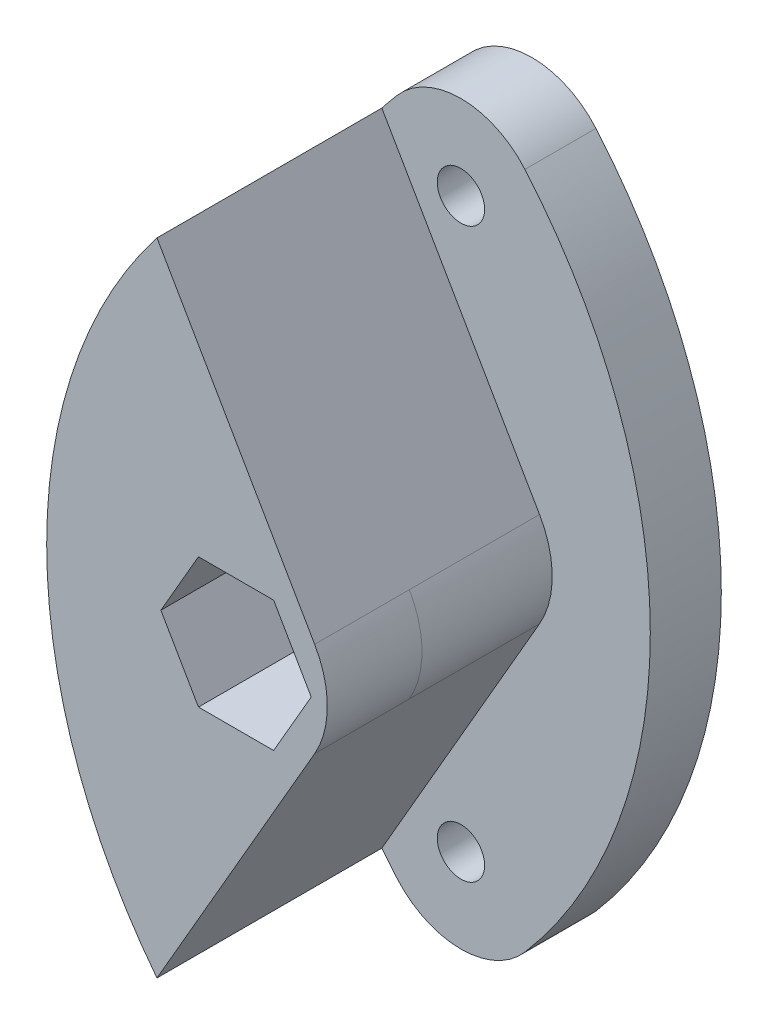
ISO-10303-21;
HEADER;
FILE_DESCRIPTION(('STEP AP214'),'2;1');
FILE_NAME('part.step','',(''),(''),'','','');
FILE_SCHEMA(('AUTOMOTIVE_DESIGN { 1 0 10303 214 1 1 1 1 }'));
ENDSEC;
DATA;
#1=APPLICATION_CONTEXT('core data for automotive mechanical design processes');
#2=APPLICATION_PROTOCOL_DEFINITION('international standard','automotive_design',2000,#1);
#3=PRODUCT_CONTEXT('',#1,'mechanical');
#4=PRODUCT('Part','Part','',(#3));
#5=PRODUCT_RELATED_PRODUCT_CATEGORY('part','',(#4));
#6=PRODUCT_DEFINITION_FORMATION('','',#4);
#7=PRODUCT_DEFINITION_CONTEXT('part definition',#1,'design');
#8=PRODUCT_DEFINITION('design','',#6,#7);
#9=PRODUCT_DEFINITION_SHAPE('','',#8);
#10=(LENGTH_UNIT() NAMED_UNIT(*) SI_UNIT(.MILLI.,.METRE.));
#11=(NAMED_UNIT(*) PLANE_ANGLE_UNIT() SI_UNIT($,.RADIAN.));
#12=(NAMED_UNIT(*) SI_UNIT($,.STERADIAN.) SOLID_ANGLE_UNIT());
#13=UNCERTAINTY_MEASURE_WITH_UNIT(LENGTH_MEASURE(1.E-05),#10,'distance_accuracy_value','');
#14=(GEOMETRIC_REPRESENTATION_CONTEXT(3) GLOBAL_UNCERTAINTY_ASSIGNED_CONTEXT((#13)) GLOBAL_UNIT_ASSIGNED_CONTEXT((#10,
#11,#12)) REPRESENTATION_CONTEXT('',''));
#15=CARTESIAN_POINT('',(0.,0.,0.));
#16=DIRECTION('',(0.,0.,1.));
#17=DIRECTION('',(1.,0.,0.));
#18=AXIS2_PLACEMENT_3D('',#15,#16,#17);
#19=CARTESIAN_POINT('',(13.856406460551,7.99999999999999,-5.5));
#20=DIRECTION('',(0.866025403784439,0.5,0.));
#21=DIRECTION('',(-0.5,0.866025403784439,0.));
#22=AXIS2_PLACEMENT_3D('',#19,#20,#21);
#23=PLANE('',#22);
#24=DIRECTION('',(-0.5,0.866025403784439,0.));
#25=VECTOR('',#24,1.);
#26=CARTESIAN_POINT('',(13.856406460551,7.99999999999999,4.));
#27=LINE('',#26,#25);
#28=CARTESIAN_POINT('',(17.3205080756888,1.99999999999999,4.));
#29=VERTEX_POINT('',#28);
#30=CARTESIAN_POINT('',(10.6588729132802,13.538290562779,4.));
#31=VERTEX_POINT('',#30);
#32=EDGE_CURVE('E181',#29,#31,#27,.T.);
#33=ORIENTED_EDGE('',*,*,#32,.F.);
#34=DIRECTION('',(0.,0.,-1.));
#35=VECTOR('',#34,1.);
#36=CARTESIAN_POINT('',(17.3205080756888,1.99999999999999,-5.5));
#37=LINE('',#36,#35);
#38=CARTESIAN_POINT('',(17.3205080756888,1.99999999999999,0.));
#39=VERTEX_POINT('',#38);
#40=EDGE_CURVE('E308',#29,#39,#37,.T.);
#41=ORIENTED_EDGE('',*,*,#40,.T.);
#42=DIRECTION('',(0.,0.,1.));
#43=VECTOR('',#42,1.);
#44=CARTESIAN_POINT('',(17.3205080756888,1.99999999999999,-5.5));
#45=LINE('',#44,#43);
#46=CARTESIAN_POINT('',(17.3205080756888,1.99999999999999,-5.5));
#47=VERTEX_POINT('',#46);
#48=EDGE_CURVE('E295',#39,#47,#45,.F.);
#49=ORIENTED_EDGE('',*,*,#48,.T.);
#50=DIRECTION('',(-0.5,0.866025403784439,0.));
#51=VECTOR('',#50,1.);
#52=CARTESIAN_POINT('',(13.856406460551,7.99999999999999,-5.5));
#53=LINE('',#52,#51);
#54=CARTESIAN_POINT('',(10.6588729132802,13.538290562779,-5.5));
#55=VERTEX_POINT('',#54);
#56=EDGE_CURVE('E256',#47,#55,#53,.T.);
#57=ORIENTED_EDGE('',*,*,#56,.T.);
#58=DIRECTION('',(0.,0.,1.));
#59=VECTOR('',#58,1.);
#60=CARTESIAN_POINT('',(10.6588729132802,13.538290562779,-5.5));
#61=LINE('',#60,#59);
#62=EDGE_CURVE('E277',#55,#31,#61,.T.);
#63=ORIENTED_EDGE('',*,*,#62,.T.);
#64=EDGE_LOOP('',(#33,#41,#49,#57,#63));
#65=FACE_BOUND('',#64,.T.);
#66=ADVANCED_FACE('F36',(#65),#23,.T.);
#67=CARTESIAN_POINT('',(13.856406460551,-8.,-5.5));
#68=DIRECTION('',(0.866025403784439,-0.5,0.));
#69=DIRECTION('',(0.5,0.866025403784439,0.));
#70=AXIS2_PLACEMENT_3D('',#67,#68,#69);
#71=PLANE('',#70);
#72=DIRECTION('',(0.,0.,1.));
#73=VECTOR('',#72,1.);
#74=CARTESIAN_POINT('',(17.3205080756888,-2.00000000000001,-5.5));
#75=LINE('',#74,#73);
#76=CARTESIAN_POINT('',(17.3205080756888,-2.00000000000001,-5.5));
#77=VERTEX_POINT('',#76);
#78=CARTESIAN_POINT('',(17.3205080756888,-2.00000000000001,0.));
#79=VERTEX_POINT('',#78);
#80=EDGE_CURVE('E282',#77,#79,#75,.T.);
#81=ORIENTED_EDGE('',*,*,#80,.T.);
#82=DIRECTION('',(0.,0.,-1.));
#83=VECTOR('',#82,1.);
#84=CARTESIAN_POINT('',(17.3205080756888,-2.00000000000001,-5.5));
#85=LINE('',#84,#83);
#86=CARTESIAN_POINT('',(17.3205080756888,-2.00000000000001,4.));
#87=VERTEX_POINT('',#86);
#88=EDGE_CURVE('E44',#79,#87,#85,.F.);
#89=ORIENTED_EDGE('',*,*,#88,.T.);
#90=DIRECTION('',(0.5,0.866025403784439,0.));
#91=VECTOR('',#90,1.);
#92=CARTESIAN_POINT('',(13.856406460551,-8.,4.));
#93=LINE('',#92,#91);
#94=CARTESIAN_POINT('',(10.6588729132802,-13.538290562779,4.));
#95=VERTEX_POINT('',#94);
#96=EDGE_CURVE('E186',#95,#87,#93,.T.);
#97=ORIENTED_EDGE('',*,*,#96,.F.);
#98=DIRECTION('',(0.,0.,1.));
#99=VECTOR('',#98,1.);
#100=CARTESIAN_POINT('',(10.6588729132802,-13.538290562779,-5.5));
#101=LINE('',#100,#99);
#102=CARTESIAN_POINT('',(10.6588729132802,-13.538290562779,-5.5));
#103=VERTEX_POINT('',#102);
#104=EDGE_CURVE('E279',#103,#95,#101,.T.);
#105=ORIENTED_EDGE('',*,*,#104,.F.);
#106=DIRECTION('',(0.5,0.866025403784439,0.));
#107=VECTOR('',#106,1.);
#108=CARTESIAN_POINT('',(13.856406460551,-8.,-5.5));
#109=LINE('',#108,#107);
#110=EDGE_CURVE('E280',#103,#77,#109,.T.);
#111=ORIENTED_EDGE('',*,*,#110,.T.);
#112=EDGE_LOOP('',(#81,#89,#97,#105,#111));
#113=FACE_BOUND('',#112,.T.);
#114=ADVANCED_FACE('F355',(#113),#71,.T.);
#115=CARTESIAN_POINT('',(28.,0.,-5.5));
#116=DIRECTION('',(0.,0.,1.));
#117=DIRECTION('',(1.,0.,0.));
#118=AXIS2_PLACEMENT_3D('',#115,#116,#117);
#119=CYLINDRICAL_SURFACE('',#118,22.);
#120=ORIENTED_EDGE('',*,*,#104,.T.);
#121=CARTESIAN_POINT('',(28.,0.,4.));
#122=DIRECTION('',(0.,0.,1.));
#123=DIRECTION('',(1.,0.,0.));
#124=AXIS2_PLACEMENT_3D('',#121,#122,#123);
#125=CIRCLE('',#124,22.);
#126=EDGE_CURVE('E183',#31,#95,#125,.T.);
#127=ORIENTED_EDGE('',*,*,#126,.F.);
#128=ORIENTED_EDGE('',*,*,#62,.F.);
#129=CARTESIAN_POINT('',(28.,0.,-5.5));
#130=DIRECTION('',(0.,0.,1.));
#131=DIRECTION('',(1.,0.,0.));
#132=AXIS2_PLACEMENT_3D('',#129,#130,#131);
#133=CIRCLE('',#132,22.);
#134=CARTESIAN_POINT('',(11.2963547479635,14.3174102160313,-5.5));
#135=VERTEX_POINT('',#134);
#136=EDGE_CURVE('E226',#135,#55,#133,.T.);
#137=ORIENTED_EDGE('',*,*,#136,.F.);
#138=DIRECTION('',(0.,0.,1.));
#139=VECTOR('',#138,1.);
#140=CARTESIAN_POINT('',(11.2963547479635,14.3174102160313,-8.5));
#141=LINE('',#140,#139);
#142=CARTESIAN_POINT('',(11.2963547479635,14.3174102160313,-8.5));
#143=VERTEX_POINT('',#142);
#144=EDGE_CURVE('E234',#143,#135,#141,.T.);
#145=ORIENTED_EDGE('',*,*,#144,.F.);
#146=CARTESIAN_POINT('',(28.,0.,-8.5));
#147=DIRECTION('',(0.,0.,1.));
#148=DIRECTION('',(1.,0.,0.));
#149=AXIS2_PLACEMENT_3D('',#146,#147,#148);
#150=CIRCLE('',#149,22.);
#151=CARTESIAN_POINT('',(11.2963547479635,-14.3174102160313,-8.5));
#152=VERTEX_POINT('',#151);
#153=EDGE_CURVE('E231',#143,#152,#150,.T.);
#154=ORIENTED_EDGE('',*,*,#153,.T.);
#155=DIRECTION('',(0.,0.,1.));
#156=VECTOR('',#155,1.);
#157=CARTESIAN_POINT('',(11.2963547479635,-14.3174102160313,-8.5));
#158=LINE('',#157,#156);
#159=CARTESIAN_POINT('',(11.2963547479635,-14.3174102160313,-5.5));
#160=VERTEX_POINT('',#159);
#161=EDGE_CURVE('E258',#152,#160,#158,.T.);
#162=ORIENTED_EDGE('',*,*,#161,.T.);
#163=EDGE_CURVE('E244',#103,#160,#133,.T.);
#164=ORIENTED_EDGE('',*,*,#163,.F.);
#165=EDGE_LOOP('',(#120,#127,#128,#137,#145,#154,#162,#164));
#166=FACE_BOUND('',#165,.T.);
#167=ADVANCED_FACE('F274',(#166),#119,.T.);
#168=CARTESIAN_POINT('',(13.856406460551,0.,-5.5));
#169=DIRECTION('',(0.,0.,1.));
#170=DIRECTION('',(1.,0.,0.));
#171=AXIS2_PLACEMENT_3D('',#168,#169,#170);
#172=CYLINDRICAL_SURFACE('',#171,4.);
#173=CARTESIAN_POINT('',(13.856406460551,0.,-5.5));
#174=DIRECTION('',(0.,0.,1.));
#175=DIRECTION('',(1.,0.,0.));
#176=AXIS2_PLACEMENT_3D('',#173,#174,#175);
#177=CIRCLE('',#176,4.);
#178=EDGE_CURVE('E298',#47,#77,#177,.F.);
#179=ORIENTED_EDGE('',*,*,#178,.F.);
#180=ORIENTED_EDGE('',*,*,#48,.F.);
#181=CARTESIAN_POINT('',(13.856406460551,0.,0.));
#182=DIRECTION('',(0.,0.,1.));
#183=DIRECTION('',(1.,0.,0.));
#184=AXIS2_PLACEMENT_3D('',#181,#182,#183);
#185=CIRCLE('',#184,4.);
#186=EDGE_CURVE('E299',#79,#39,#185,.T.);
#187=ORIENTED_EDGE('',*,*,#186,.F.);
#188=ORIENTED_EDGE('',*,*,#80,.F.);
#189=EDGE_LOOP('',(#179,#180,#187,#188));
#190=FACE_BOUND('',#189,.T.);
#191=ADVANCED_FACE('F359',(#190),#172,.T.);
#192=CARTESIAN_POINT('',(14.,12.,-8.5));
#193=DIRECTION('',(0.,0.,1.));
#194=DIRECTION('',(1.,0.,0.));
#195=AXIS2_PLACEMENT_3D('',#192,#193,#194);
#196=CYLINDRICAL_SURFACE('',#195,3.56091108541422);
#197=CARTESIAN_POINT('',(14.,12.,-5.5));
#198=DIRECTION('',(0.,0.,-1.));
#199=DIRECTION('',(-1.,0.,0.));
#200=AXIS2_PLACEMENT_3D('',#197,#198,#199);
#201=CIRCLE('',#200,3.56091108541422);
#202=CARTESIAN_POINT('',(16.7036452520365,14.3174102160313,-5.5));
#203=VERTEX_POINT('',#202);
#204=EDGE_CURVE('E235',#135,#203,#201,.T.);
#205=ORIENTED_EDGE('',*,*,#204,.T.);
#206=DIRECTION('',(0.,0.,1.));
#207=VECTOR('',#206,1.);
#208=CARTESIAN_POINT('',(16.7036452520365,14.3174102160313,-8.5));
#209=LINE('',#208,#207);
#210=CARTESIAN_POINT('',(16.7036452520365,14.3174102160313,-8.5));
#211=VERTEX_POINT('',#210);
#212=EDGE_CURVE('E253',#211,#203,#209,.T.);
#213=ORIENTED_EDGE('',*,*,#212,.F.);
#214=CARTESIAN_POINT('',(14.,12.,-8.5));
#215=DIRECTION('',(0.,0.,-1.));
#216=DIRECTION('',(-1.,0.,0.));
#217=AXIS2_PLACEMENT_3D('',#214,#215,#216);
#218=CIRCLE('',#217,3.56091108541422);
#219=EDGE_CURVE('E222',#143,#211,#218,.T.);
#220=ORIENTED_EDGE('',*,*,#219,.F.);
#221=ORIENTED_EDGE('',*,*,#144,.T.);
#222=EDGE_LOOP('',(#205,#213,#220,#221));
#223=FACE_BOUND('',#222,.T.);
#224=ADVANCED_FACE('F266',(#223),#196,.T.);
#225=CARTESIAN_POINT('',(0.,0.,-8.5));
#226=DIRECTION('',(0.,0.,1.));
#227=DIRECTION('',(1.,0.,0.));
#228=AXIS2_PLACEMENT_3D('',#225,#226,#227);
#229=CYLINDRICAL_SURFACE('',#228,22.);
#230=CARTESIAN_POINT('',(0.,0.,-5.5));
#231=DIRECTION('',(0.,0.,-1.));
#232=DIRECTION('',(-1.,0.,0.));
#233=AXIS2_PLACEMENT_3D('',#230,#231,#232);
#234=CIRCLE('',#233,22.);
#235=CARTESIAN_POINT('',(16.7036452520365,-14.3174102160313,-5.5));
#236=VERTEX_POINT('',#235);
#237=EDGE_CURVE('E238',#203,#236,#234,.T.);
#238=ORIENTED_EDGE('',*,*,#237,.T.);
#239=DIRECTION('',(0.,0.,1.));
#240=VECTOR('',#239,1.);
#241=CARTESIAN_POINT('',(16.7036452520365,-14.3174102160313,-8.5));
#242=LINE('',#241,#240);
#243=CARTESIAN_POINT('',(16.7036452520365,-14.3174102160313,-8.5));
#244=VERTEX_POINT('',#243);
#245=EDGE_CURVE('E257',#244,#236,#242,.T.);
#246=ORIENTED_EDGE('',*,*,#245,.F.);
#247=CARTESIAN_POINT('',(0.,0.,-8.5));
#248=DIRECTION('',(0.,0.,-1.));
#249=DIRECTION('',(-1.,0.,0.));
#250=AXIS2_PLACEMENT_3D('',#247,#248,#249);
#251=CIRCLE('',#250,22.);
#252=EDGE_CURVE('E225',#211,#244,#251,.T.);
#253=ORIENTED_EDGE('',*,*,#252,.F.);
#254=ORIENTED_EDGE('',*,*,#212,.T.);
#255=EDGE_LOOP('',(#238,#246,#253,#254));
#256=FACE_BOUND('',#255,.T.);
#257=ADVANCED_FACE('F352',(#256),#229,.T.);
#258=CARTESIAN_POINT('',(14.,-12.,-8.5));
#259=DIRECTION('',(0.,0.,1.));
#260=DIRECTION('',(1.,0.,0.));
#261=AXIS2_PLACEMENT_3D('',#258,#259,#260);
#262=CYLINDRICAL_SURFACE('',#261,3.56091108541422);
#263=CARTESIAN_POINT('',(14.,-12.,-5.5));
#264=DIRECTION('',(0.,0.,1.));
#265=DIRECTION('',(1.,0.,0.));
#266=AXIS2_PLACEMENT_3D('',#263,#264,#265);
#267=CIRCLE('',#266,3.56091108541422);
#268=EDGE_CURVE('E241',#160,#236,#267,.T.);
#269=ORIENTED_EDGE('',*,*,#268,.F.);
#270=ORIENTED_EDGE('',*,*,#161,.F.);
#271=CARTESIAN_POINT('',(14.,-12.,-8.5));
#272=DIRECTION('',(0.,0.,1.));
#273=DIRECTION('',(1.,0.,0.));
#274=AXIS2_PLACEMENT_3D('',#271,#272,#273);
#275=CIRCLE('',#274,3.56091108541422);
#276=EDGE_CURVE('E228',#152,#244,#275,.T.);
#277=ORIENTED_EDGE('',*,*,#276,.T.);
#278=ORIENTED_EDGE('',*,*,#245,.T.);
#279=EDGE_LOOP('',(#269,#270,#277,#278));
#280=FACE_BOUND('',#279,.T.);
#281=ADVANCED_FACE('F343',(#280),#262,.T.);
#282=CARTESIAN_POINT('',(7.,6.,-8.5));
#283=DIRECTION('',(0.,0.,-1.));
#284=DIRECTION('',(-1.,0.,0.));
#285=AXIS2_PLACEMENT_3D('',#282,#283,#284);
#286=PLANE('',#285);
#287=CARTESIAN_POINT('',(14.,0.,-8.5));
#288=DIRECTION('',(0.,0.,-1.));
#289=DIRECTION('',(-1.,0.,0.));
#290=AXIS2_PLACEMENT_3D('',#287,#288,#289);
#291=CIRCLE('',#290,3.24999999999999);
#292=CARTESIAN_POINT('',(10.75,0.,-8.5));
#293=VERTEX_POINT('',#292);
#294=EDGE_CURVE('E332',#293,#293,#291,.T.);
#295=ORIENTED_EDGE('',*,*,#294,.F.);
#296=EDGE_LOOP('',(#295));
#297=FACE_BOUND('',#296,.T.);
#298=CARTESIAN_POINT('',(14.,12.,-8.5));
#299=DIRECTION('',(0.,0.,-1.));
#300=DIRECTION('',(-1.,0.,0.));
#301=AXIS2_PLACEMENT_3D('',#298,#299,#300);
#302=CIRCLE('',#301,2.);
#303=CARTESIAN_POINT('',(12.,12.,-8.5));
#304=VERTEX_POINT('',#303);
#305=EDGE_CURVE('E208',#304,#304,#302,.T.);
#306=ORIENTED_EDGE('',*,*,#305,.F.);
#307=EDGE_LOOP('',(#306));
#308=FACE_BOUND('',#307,.T.);
#309=CARTESIAN_POINT('',(14.,-12.,-8.5));
#310=DIRECTION('',(0.,0.,-1.));
#311=DIRECTION('',(-1.,0.,0.));
#312=AXIS2_PLACEMENT_3D('',#309,#310,#311);
#313=CIRCLE('',#312,2.);
#314=CARTESIAN_POINT('',(12.,-12.,-8.5));
#315=VERTEX_POINT('',#314);
#316=EDGE_CURVE('E215',#315,#315,#313,.T.);
#317=ORIENTED_EDGE('',*,*,#316,.F.);
#318=EDGE_LOOP('',(#317));
#319=FACE_BOUND('',#318,.T.);
#320=ORIENTED_EDGE('',*,*,#219,.T.);
#321=ORIENTED_EDGE('',*,*,#252,.T.);
#322=ORIENTED_EDGE('',*,*,#276,.F.);
#323=ORIENTED_EDGE('',*,*,#153,.F.);
#324=EDGE_LOOP('',(#320,#321,#322,#323));
#325=FACE_BOUND('',#324,.T.);
#326=ADVANCED_FACE('F340',(#297,#308,#319,#325),#286,.T.);
#327=CARTESIAN_POINT('',(7.,6.,-5.5));
#328=DIRECTION('',(0.,0.,-1.));
#329=DIRECTION('',(-1.,0.,0.));
#330=AXIS2_PLACEMENT_3D('',#327,#328,#329);
#331=PLANE('',#330);
#332=CARTESIAN_POINT('',(14.,12.,-5.5));
#333=DIRECTION('',(0.,0.,-1.));
#334=DIRECTION('',(-1.,0.,0.));
#335=AXIS2_PLACEMENT_3D('',#332,#333,#334);
#336=CIRCLE('',#335,0.999999999999997);
#337=CARTESIAN_POINT('',(13.,12.,-5.5));
#338=VERTEX_POINT('',#337);
#339=EDGE_CURVE('E214',#338,#338,#336,.T.);
#340=ORIENTED_EDGE('',*,*,#339,.T.);
#341=EDGE_LOOP('',(#340));
#342=FACE_BOUND('',#341,.T.);
#343=CARTESIAN_POINT('',(14.,-12.,-5.5));
#344=DIRECTION('',(0.,0.,-1.));
#345=DIRECTION('',(-1.,0.,0.));
#346=AXIS2_PLACEMENT_3D('',#343,#344,#345);
#347=CIRCLE('',#346,0.999999999999997);
#348=CARTESIAN_POINT('',(13.,-12.,-5.5));
#349=VERTEX_POINT('',#348);
#350=EDGE_CURVE('E221',#349,#349,#347,.T.);
#351=ORIENTED_EDGE('',*,*,#350,.T.);
#352=EDGE_LOOP('',(#351));
#353=FACE_BOUND('',#352,.T.);
#354=ORIENTED_EDGE('',*,*,#56,.F.);
#355=ORIENTED_EDGE('',*,*,#178,.T.);
#356=ORIENTED_EDGE('',*,*,#110,.F.);
#357=ORIENTED_EDGE('',*,*,#163,.T.);
#358=ORIENTED_EDGE('',*,*,#268,.T.);
#359=ORIENTED_EDGE('',*,*,#237,.F.);
#360=ORIENTED_EDGE('',*,*,#204,.F.);
#361=ORIENTED_EDGE('',*,*,#136,.T.);
#362=EDGE_LOOP('',(#354,#355,#356,#357,#358,#359,#360,#361));
#363=FACE_BOUND('',#362,.T.);
#364=ADVANCED_FACE('F271',(#342,#353,#363),#331,.F.);
#365=CARTESIAN_POINT('',(14.,-12.,-8.5));
#366=DIRECTION('',(0.,0.,-1.));
#367=DIRECTION('',(-1.,0.,0.));
#368=AXIS2_PLACEMENT_3D('',#365,#366,#367);
#369=CYLINDRICAL_SURFACE('',#368,0.999999999999997);
#370=CARTESIAN_POINT('',(14.,-12.,-7.5));
#371=DIRECTION('',(0.,0.,-1.));
#372=DIRECTION('',(-1.,0.,0.));
#373=AXIS2_PLACEMENT_3D('',#370,#371,#372);
#374=CIRCLE('',#373,0.999999999999997);
#375=CARTESIAN_POINT('',(13.,-12.,-7.5));
#376=VERTEX_POINT('',#375);
#377=EDGE_CURVE('E218',#376,#376,#374,.T.);
#378=ORIENTED_EDGE('',*,*,#377,.T.);
#379=EDGE_LOOP('',(#378));
#380=FACE_BOUND('',#379,.T.);
#381=ORIENTED_EDGE('',*,*,#350,.F.);
#382=EDGE_LOOP('',(#381));
#383=FACE_BOUND('',#382,.T.);
#384=ADVANCED_FACE('F502',(#380,#383),#369,.F.);
#385=CARTESIAN_POINT('',(14.,-12.,-8.5));
#386=DIRECTION('',(0.,0.,-1.));
#387=DIRECTION('',(-1.,0.,0.));
#388=AXIS2_PLACEMENT_3D('',#385,#386,#387);
#389=CONICAL_SURFACE('',#388,2.,0.785398163397447);
#390=ORIENTED_EDGE('',*,*,#377,.F.);
#391=EDGE_LOOP('',(#390));
#392=FACE_BOUND('',#391,.T.);
#393=ORIENTED_EDGE('',*,*,#316,.T.);
#394=EDGE_LOOP('',(#393));
#395=FACE_BOUND('',#394,.T.);
#396=ADVANCED_FACE('F509',(#392,#395),#389,.F.);
#397=CARTESIAN_POINT('',(14.,12.,-8.5));
#398=DIRECTION('',(0.,0.,-1.));
#399=DIRECTION('',(-1.,0.,0.));
#400=AXIS2_PLACEMENT_3D('',#397,#398,#399);
#401=CYLINDRICAL_SURFACE('',#400,0.999999999999997);
#402=CARTESIAN_POINT('',(14.,12.,-7.5));
#403=DIRECTION('',(0.,0.,-1.));
#404=DIRECTION('',(-1.,0.,0.));
#405=AXIS2_PLACEMENT_3D('',#402,#403,#404);
#406=CIRCLE('',#405,0.999999999999997);
#407=CARTESIAN_POINT('',(13.,12.,-7.5));
#408=VERTEX_POINT('',#407);
#409=EDGE_CURVE('E211',#408,#408,#406,.T.);
#410=ORIENTED_EDGE('',*,*,#409,.T.);
#411=EDGE_LOOP('',(#410));
#412=FACE_BOUND('',#411,.T.);
#413=ORIENTED_EDGE('',*,*,#339,.F.);
#414=EDGE_LOOP('',(#413));
#415=FACE_BOUND('',#414,.T.);
#416=ADVANCED_FACE('F517',(#412,#415),#401,.F.);
#417=CARTESIAN_POINT('',(14.,12.,-8.5));
#418=DIRECTION('',(0.,0.,-1.));
#419=DIRECTION('',(-1.,0.,0.));
#420=AXIS2_PLACEMENT_3D('',#417,#418,#419);
#421=CONICAL_SURFACE('',#420,2.,0.785398163397447);
#422=ORIENTED_EDGE('',*,*,#409,.F.);
#423=EDGE_LOOP('',(#422));
#424=FACE_BOUND('',#423,.T.);
#425=ORIENTED_EDGE('',*,*,#305,.T.);
#426=EDGE_LOOP('',(#425));
#427=FACE_BOUND('',#426,.T.);
#428=ADVANCED_FACE('F401',(#424,#427),#421,.F.);
#429=CARTESIAN_POINT('',(0.,0.,4.));
#430=DIRECTION('',(0.,0.,1.));
#431=DIRECTION('',(1.,0.,0.));
#432=AXIS2_PLACEMENT_3D('',#429,#430,#431);
#433=PLANE('',#432);
#434=DIRECTION('',(-1.,0.,0.));
#435=VECTOR('',#434,1.);
#436=CARTESIAN_POINT('',(0.,2.75,4.));
#437=LINE('',#436,#435);
#438=CARTESIAN_POINT('',(15.5877132402715,2.75,4.));
#439=VERTEX_POINT('',#438);
#440=CARTESIAN_POINT('',(12.4122867597285,2.75,4.));
#441=VERTEX_POINT('',#440);
#442=EDGE_CURVE('E146',#439,#441,#437,.T.);
#443=ORIENTED_EDGE('',*,*,#442,.F.);
#444=DIRECTION('',(-0.499999999999999,0.866025403784439,0.));
#445=VECTOR('',#444,1.);
#446=CARTESIAN_POINT('',(12.8815698604072,7.43717782649106,4.));
#447=LINE('',#446,#445);
#448=CARTESIAN_POINT('',(17.1754264805429,0.,4.));
#449=VERTEX_POINT('',#448);
#450=EDGE_CURVE('E160',#449,#439,#447,.T.);
#451=ORIENTED_EDGE('',*,*,#450,.F.);
#452=DIRECTION('',(0.499999999999999,0.866025403784439,0.));
#453=VECTOR('',#452,1.);
#454=CARTESIAN_POINT('',(12.8815698604072,-7.43717782649106,4.));
#455=LINE('',#454,#453);
#456=CARTESIAN_POINT('',(15.5877132402715,-2.75,4.));
#457=VERTEX_POINT('',#456);
#458=EDGE_CURVE('E169',#457,#449,#455,.T.);
#459=ORIENTED_EDGE('',*,*,#458,.F.);
#460=DIRECTION('',(1.,0.,0.));
#461=VECTOR('',#460,1.);
#462=CARTESIAN_POINT('',(0.,-2.75,4.));
#463=LINE('',#462,#461);
#464=CARTESIAN_POINT('',(12.4122867597285,-2.75,4.));
#465=VERTEX_POINT('',#464);
#466=EDGE_CURVE('E171',#465,#457,#463,.T.);
#467=ORIENTED_EDGE('',*,*,#466,.F.);
#468=DIRECTION('',(0.5,-0.866025403784439,0.));
#469=VECTOR('',#468,1.);
#470=CARTESIAN_POINT('',(8.11843013959279,4.68717782649107,4.));
#471=LINE('',#470,#469);
#472=CARTESIAN_POINT('',(10.8245735194571,0.,4.));
#473=VERTEX_POINT('',#472);
#474=EDGE_CURVE('E177',#473,#465,#471,.T.);
#475=ORIENTED_EDGE('',*,*,#474,.F.);
#476=DIRECTION('',(-0.5,-0.866025403784439,0.));
#477=VECTOR('',#476,1.);
#478=CARTESIAN_POINT('',(8.11843013959279,-4.68717782649107,4.));
#479=LINE('',#478,#477);
#480=EDGE_CURVE('E164',#441,#473,#479,.T.);
#481=ORIENTED_EDGE('',*,*,#480,.F.);
#482=EDGE_LOOP('',(#443,#451,#459,#467,#475,#481));
#483=FACE_BOUND('',#482,.T.);
#484=ORIENTED_EDGE('',*,*,#96,.T.);
#485=CARTESIAN_POINT('',(13.856406460551,0.,4.));
#486=DIRECTION('',(0.,0.,1.));
#487=DIRECTION('',(1.,0.,0.));
#488=AXIS2_PLACEMENT_3D('',#485,#486,#487);
#489=CIRCLE('',#488,4.);
#490=EDGE_CURVE('E11',#87,#29,#489,.T.);
#491=ORIENTED_EDGE('',*,*,#490,.T.);
#492=ORIENTED_EDGE('',*,*,#32,.T.);
#493=ORIENTED_EDGE('',*,*,#126,.T.);
#494=EDGE_LOOP('',(#484,#491,#492,#493));
#495=FACE_BOUND('',#494,.T.);
#496=ADVANCED_FACE('F158',(#483,#495),#433,.T.);
#497=CARTESIAN_POINT('',(0.,0.,-1.5));
#498=DIRECTION('',(0.,0.,-1.));
#499=DIRECTION('',(-1.,0.,0.));
#500=AXIS2_PLACEMENT_3D('',#497,#498,#499);
#501=PLANE('',#500);
#502=CARTESIAN_POINT('',(14.,0.,-1.5));
#503=DIRECTION('',(0.,0.,-1.));
#504=DIRECTION('',(-1.,0.,0.));
#505=AXIS2_PLACEMENT_3D('',#502,#503,#504);
#506=CIRCLE('',#505,1.6);
#507=CARTESIAN_POINT('',(12.4,0.,-1.5));
#508=VERTEX_POINT('',#507);
#509=EDGE_CURVE('E165',#508,#508,#506,.T.);
#510=ORIENTED_EDGE('',*,*,#509,.T.);
#511=EDGE_LOOP('',(#510));
#512=FACE_BOUND('',#511,.T.);
#513=DIRECTION('',(-1.,0.,0.));
#514=VECTOR('',#513,1.);
#515=CARTESIAN_POINT('',(0.,-2.75,-1.5));
#516=LINE('',#515,#514);
#517=CARTESIAN_POINT('',(15.5877132402715,-2.75,-1.5));
#518=VERTEX_POINT('',#517);
#519=CARTESIAN_POINT('',(12.4122867597285,-2.75,-1.5));
#520=VERTEX_POINT('',#519);
#521=EDGE_CURVE('E188',#518,#520,#516,.T.);
#522=ORIENTED_EDGE('',*,*,#521,.F.);
#523=DIRECTION('',(-0.499999999999999,-0.866025403784439,0.));
#524=VECTOR('',#523,1.);
#525=CARTESIAN_POINT('',(12.8815698604072,-7.43717782649106,-1.5));
#526=LINE('',#525,#524);
#527=CARTESIAN_POINT('',(17.1754264805429,0.,-1.5));
#528=VERTEX_POINT('',#527);
#529=EDGE_CURVE('E198',#528,#518,#526,.T.);
#530=ORIENTED_EDGE('',*,*,#529,.F.);
#531=DIRECTION('',(0.499999999999999,-0.866025403784439,0.));
#532=VECTOR('',#531,1.);
#533=CARTESIAN_POINT('',(12.8815698604072,7.43717782649106,-1.5));
#534=LINE('',#533,#532);
#535=CARTESIAN_POINT('',(15.5877132402715,2.75,-1.5));
#536=VERTEX_POINT('',#535);
#537=EDGE_CURVE('E196',#536,#528,#534,.T.);
#538=ORIENTED_EDGE('',*,*,#537,.F.);
#539=DIRECTION('',(1.,0.,0.));
#540=VECTOR('',#539,1.);
#541=CARTESIAN_POINT('',(0.,2.75,-1.5));
#542=LINE('',#541,#540);
#543=CARTESIAN_POINT('',(12.4122867597285,2.75,-1.5));
#544=VERTEX_POINT('',#543);
#545=EDGE_CURVE('E149',#544,#536,#542,.T.);
#546=ORIENTED_EDGE('',*,*,#545,.F.);
#547=DIRECTION('',(0.5,0.866025403784439,0.));
#548=VECTOR('',#547,1.);
#549=CARTESIAN_POINT('',(8.11843013959279,-4.68717782649107,-1.5));
#550=LINE('',#549,#548);
#551=CARTESIAN_POINT('',(10.8245735194571,0.,-1.5));
#552=VERTEX_POINT('',#551);
#553=EDGE_CURVE('E193',#552,#544,#550,.T.);
#554=ORIENTED_EDGE('',*,*,#553,.F.);
#555=DIRECTION('',(-0.5,0.866025403784439,0.));
#556=VECTOR('',#555,1.);
#557=CARTESIAN_POINT('',(8.1184301395928,4.68717782649107,-1.5));
#558=LINE('',#557,#556);
#559=EDGE_CURVE('E191',#520,#552,#558,.T.);
#560=ORIENTED_EDGE('',*,*,#559,.F.);
#561=EDGE_LOOP('',(#522,#530,#538,#546,#554,#560));
#562=FACE_BOUND('',#561,.T.);
#563=ADVANCED_FACE('F400',(#512,#562),#501,.F.);
#564=CARTESIAN_POINT('',(12.8815698604072,7.43717782649106,-1.5));
#565=DIRECTION('',(-0.866025403784439,-0.499999999999999,0.));
#566=DIRECTION('',(0.499999999999999,-0.866025403784439,0.));
#567=AXIS2_PLACEMENT_3D('',#564,#565,#566);
#568=PLANE('',#567);
#569=DIRECTION('',(0.,0.,1.));
#570=VECTOR('',#569,1.);
#571=CARTESIAN_POINT('',(17.1754264805429,0.,-1.5));
#572=LINE('',#571,#570);
#573=EDGE_CURVE('E154',#528,#449,#572,.T.);
#574=ORIENTED_EDGE('',*,*,#573,.T.);
#575=ORIENTED_EDGE('',*,*,#450,.T.);
#576=DIRECTION('',(0.,0.,1.));
#577=VECTOR('',#576,1.);
#578=CARTESIAN_POINT('',(15.5877132402715,2.75,-1.5));
#579=LINE('',#578,#577);
#580=EDGE_CURVE('E142',#536,#439,#579,.T.);
#581=ORIENTED_EDGE('',*,*,#580,.F.);
#582=ORIENTED_EDGE('',*,*,#537,.T.);
#583=EDGE_LOOP('',(#574,#575,#581,#582));
#584=FACE_BOUND('',#583,.T.);
#585=ADVANCED_FACE('F167',(#584),#568,.T.);
#586=CARTESIAN_POINT('',(0.,2.75,-1.5));
#587=DIRECTION('',(0.,-1.,0.));
#588=DIRECTION('',(0.,0.,-1.));
#589=AXIS2_PLACEMENT_3D('',#586,#587,#588);
#590=PLANE('',#589);
#591=ORIENTED_EDGE('',*,*,#580,.T.);
#592=ORIENTED_EDGE('',*,*,#442,.T.);
#593=DIRECTION('',(0.,0.,1.));
#594=VECTOR('',#593,1.);
#595=CARTESIAN_POINT('',(12.4122867597285,2.75,-1.5));
#596=LINE('',#595,#594);
#597=EDGE_CURVE('E153',#544,#441,#596,.T.);
#598=ORIENTED_EDGE('',*,*,#597,.F.);
#599=ORIENTED_EDGE('',*,*,#545,.T.);
#600=EDGE_LOOP('',(#591,#592,#598,#599));
#601=FACE_BOUND('',#600,.T.);
#602=ADVANCED_FACE('F144',(#601),#590,.T.);
#603=CARTESIAN_POINT('',(8.11843013959279,-4.68717782649107,-1.5));
#604=DIRECTION('',(0.866025403784439,-0.5,0.));
#605=DIRECTION('',(0.5,0.866025403784439,0.));
#606=AXIS2_PLACEMENT_3D('',#603,#604,#605);
#607=PLANE('',#606);
#608=ORIENTED_EDGE('',*,*,#597,.T.);
#609=ORIENTED_EDGE('',*,*,#480,.T.);
#610=DIRECTION('',(0.,0.,1.));
#611=VECTOR('',#610,1.);
#612=CARTESIAN_POINT('',(10.8245735194571,0.,-1.5));
#613=LINE('',#612,#611);
#614=EDGE_CURVE('E204',#552,#473,#613,.T.);
#615=ORIENTED_EDGE('',*,*,#614,.F.);
#616=ORIENTED_EDGE('',*,*,#553,.T.);
#617=EDGE_LOOP('',(#608,#609,#615,#616));
#618=FACE_BOUND('',#617,.T.);
#619=ADVANCED_FACE('F459',(#618),#607,.T.);
#620=CARTESIAN_POINT('',(8.1184301395928,4.68717782649107,-1.5));
#621=DIRECTION('',(0.866025403784439,0.5,0.));
#622=DIRECTION('',(-0.5,0.866025403784439,0.));
#623=AXIS2_PLACEMENT_3D('',#620,#621,#622);
#624=PLANE('',#623);
#625=ORIENTED_EDGE('',*,*,#614,.T.);
#626=ORIENTED_EDGE('',*,*,#474,.T.);
#627=DIRECTION('',(0.,0.,1.));
#628=VECTOR('',#627,1.);
#629=CARTESIAN_POINT('',(12.4122867597285,-2.75,-1.5));
#630=LINE('',#629,#628);
#631=EDGE_CURVE('E206',#520,#465,#630,.T.);
#632=ORIENTED_EDGE('',*,*,#631,.F.);
#633=ORIENTED_EDGE('',*,*,#559,.T.);
#634=EDGE_LOOP('',(#625,#626,#632,#633));
#635=FACE_BOUND('',#634,.T.);
#636=ADVANCED_FACE('F451',(#635),#624,.T.);
#637=CARTESIAN_POINT('',(0.,-2.75,-1.5));
#638=DIRECTION('',(0.,1.,0.));
#639=DIRECTION('',(0.,0.,1.));
#640=AXIS2_PLACEMENT_3D('',#637,#638,#639);
#641=PLANE('',#640);
#642=ORIENTED_EDGE('',*,*,#631,.T.);
#643=ORIENTED_EDGE('',*,*,#466,.T.);
#644=DIRECTION('',(0.,0.,1.));
#645=VECTOR('',#644,1.);
#646=CARTESIAN_POINT('',(15.5877132402715,-2.75,-1.5));
#647=LINE('',#646,#645);
#648=EDGE_CURVE('E200',#518,#457,#647,.T.);
#649=ORIENTED_EDGE('',*,*,#648,.F.);
#650=ORIENTED_EDGE('',*,*,#521,.T.);
#651=EDGE_LOOP('',(#642,#643,#649,#650));
#652=FACE_BOUND('',#651,.T.);
#653=ADVANCED_FACE('F442',(#652),#641,.T.);
#654=CARTESIAN_POINT('',(12.8815698604072,-7.43717782649106,-1.5));
#655=DIRECTION('',(-0.866025403784439,0.499999999999999,0.));
#656=DIRECTION('',(-0.499999999999999,-0.866025403784439,0.));
#657=AXIS2_PLACEMENT_3D('',#654,#655,#656);
#658=PLANE('',#657);
#659=ORIENTED_EDGE('',*,*,#648,.T.);
#660=ORIENTED_EDGE('',*,*,#458,.T.);
#661=ORIENTED_EDGE('',*,*,#573,.F.);
#662=ORIENTED_EDGE('',*,*,#529,.T.);
#663=EDGE_LOOP('',(#659,#660,#661,#662));
#664=FACE_BOUND('',#663,.T.);
#665=ADVANCED_FACE('F434',(#664),#658,.T.);
#666=CARTESIAN_POINT('',(14.,0.,-8.5));
#667=DIRECTION('',(0.,0.,-1.));
#668=DIRECTION('',(-1.,0.,0.));
#669=AXIS2_PLACEMENT_3D('',#666,#667,#668);
#670=CYLINDRICAL_SURFACE('',#669,1.6);
#671=CARTESIAN_POINT('',(14.,0.,-6.5));
#672=DIRECTION('',(0.,0.,-1.));
#673=DIRECTION('',(-1.,0.,0.));
#674=AXIS2_PLACEMENT_3D('',#671,#672,#673);
#675=CIRCLE('',#674,1.6);
#676=CARTESIAN_POINT('',(12.4,0.,-6.5));
#677=VERTEX_POINT('',#676);
#678=EDGE_CURVE('E323',#677,#677,#675,.T.);
#679=ORIENTED_EDGE('',*,*,#678,.T.);
#680=EDGE_LOOP('',(#679));
#681=FACE_BOUND('',#680,.T.);
#682=ORIENTED_EDGE('',*,*,#509,.F.);
#683=EDGE_LOOP('',(#682));
#684=FACE_BOUND('',#683,.T.);
#685=ADVANCED_FACE('F426',(#681,#684),#670,.F.);
#686=CARTESIAN_POINT('',(15.6,0.,-6.5));
#687=DIRECTION('',(0.,0.,1.));
#688=DIRECTION('',(1.,0.,0.));
#689=AXIS2_PLACEMENT_3D('',#686,#687,#688);
#690=PLANE('',#689);
#691=ORIENTED_EDGE('',*,*,#678,.F.);
#692=EDGE_LOOP('',(#691));
#693=FACE_BOUND('',#692,.T.);
#694=CARTESIAN_POINT('',(14.,0.,-6.5));
#695=DIRECTION('',(0.,0.,-1.));
#696=DIRECTION('',(-1.,0.,0.));
#697=AXIS2_PLACEMENT_3D('',#694,#695,#696);
#698=CIRCLE('',#697,3.25);
#699=CARTESIAN_POINT('',(10.75,0.,-6.5));
#700=VERTEX_POINT('',#699);
#701=EDGE_CURVE('E328',#700,#700,#698,.T.);
#702=ORIENTED_EDGE('',*,*,#701,.T.);
#703=EDGE_LOOP('',(#702));
#704=FACE_BOUND('',#703,.T.);
#705=ADVANCED_FACE('F419',(#693,#704),#690,.F.);
#706=CARTESIAN_POINT('',(14.,0.,-8.5));
#707=DIRECTION('',(0.,0.,-1.));
#708=DIRECTION('',(-1.,0.,0.));
#709=AXIS2_PLACEMENT_3D('',#706,#707,#708);
#710=CYLINDRICAL_SURFACE('',#709,3.25);
#711=ORIENTED_EDGE('',*,*,#701,.F.);
#712=EDGE_LOOP('',(#711));
#713=FACE_BOUND('',#712,.T.);
#714=ORIENTED_EDGE('',*,*,#294,.T.);
#715=EDGE_LOOP('',(#714));
#716=FACE_BOUND('',#715,.T.);
#717=ADVANCED_FACE('F338',(#713,#716),#710,.F.);
#718=CARTESIAN_POINT('',(13.856406460551,0.,-5.5));
#719=DIRECTION('',(0.,0.,-1.));
#720=DIRECTION('',(-1.,0.,0.));
#721=AXIS2_PLACEMENT_3D('',#718,#719,#720);
#722=CYLINDRICAL_SURFACE('',#721,4.);
#723=ORIENTED_EDGE('',*,*,#490,.F.);
#724=ORIENTED_EDGE('',*,*,#88,.F.);
#725=ORIENTED_EDGE('',*,*,#186,.T.);
#726=ORIENTED_EDGE('',*,*,#40,.F.);
#727=EDGE_LOOP('',(#723,#724,#725,#726));
#728=FACE_BOUND('',#727,.T.);
#729=ADVANCED_FACE('F38',(#728),#722,.T.);
#730=CLOSED_SHELL('',(#66,#114,#167,#191,#224,#257,#281,#326,#364,#384,#396,#416,#428,#496,#563,
#585,#602,#619,#636,#653,#665,#685,#705,#717,#729));
#731=MANIFOLD_SOLID_BREP('B2',#730);
#732=ADVANCED_BREP_SHAPE_REPRESENTATION('',(#18,#731),#14);
#733=SHAPE_DEFINITION_REPRESENTATION(#9,#732);
ENDSEC;
END-ISO-10303-21;
